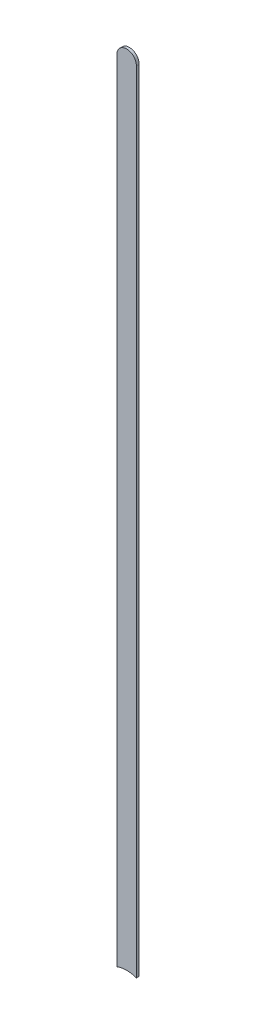
ISO-10303-21;
HEADER;
FILE_DESCRIPTION(('STEP AP214'),'2;1');
FILE_NAME('part.step','',(''),(''),'','','');
FILE_SCHEMA(('AUTOMOTIVE_DESIGN { 1 0 10303 214 1 1 1 1 }'));
ENDSEC;
DATA;
#1=APPLICATION_CONTEXT('core data for automotive mechanical design processes');
#2=APPLICATION_PROTOCOL_DEFINITION('international standard','automotive_design',2000,#1);
#3=PRODUCT_CONTEXT('',#1,'mechanical');
#4=PRODUCT('Part','Part','',(#3));
#5=PRODUCT_RELATED_PRODUCT_CATEGORY('part','',(#4));
#6=PRODUCT_DEFINITION_FORMATION('','',#4);
#7=PRODUCT_DEFINITION_CONTEXT('part definition',#1,'design');
#8=PRODUCT_DEFINITION('design','',#6,#7);
#9=PRODUCT_DEFINITION_SHAPE('','',#8);
#10=(LENGTH_UNIT() NAMED_UNIT(*) SI_UNIT(.MILLI.,.METRE.));
#11=(NAMED_UNIT(*) PLANE_ANGLE_UNIT() SI_UNIT($,.RADIAN.));
#12=(NAMED_UNIT(*) SI_UNIT($,.STERADIAN.) SOLID_ANGLE_UNIT());
#13=UNCERTAINTY_MEASURE_WITH_UNIT(LENGTH_MEASURE(1.E-05),#10,'distance_accuracy_value','');
#14=(GEOMETRIC_REPRESENTATION_CONTEXT(3) GLOBAL_UNCERTAINTY_ASSIGNED_CONTEXT((#13)) GLOBAL_UNIT_ASSIGNED_CONTEXT((#10,
#11,#12)) REPRESENTATION_CONTEXT('',''));
#15=CARTESIAN_POINT('',(0.,0.,0.));
#16=DIRECTION('',(0.,0.,1.));
#17=DIRECTION('',(1.,0.,0.));
#18=AXIS2_PLACEMENT_3D('',#15,#16,#17);
#19=CARTESIAN_POINT('',(90.34397222,84.5191196794978,0.));
#20=DIRECTION('',(-1.,0.,0.));
#21=DIRECTION('',(0.,1.,0.));
#22=AXIS2_PLACEMENT_3D('',#19,#20,#21);
#23=PLANE('',#22);
#24=DIRECTION('',(0.,1.,0.));
#25=VECTOR('',#24,1.);
#26=CARTESIAN_POINT('',(90.34397222,84.18697158,0.03556));
#27=LINE('',#26,#25);
#28=CARTESIAN_POINT('',(90.34397222,84.5191196794978,0.03556));
#29=VERTEX_POINT('',#28);
#30=CARTESIAN_POINT('',(90.34397222,94.78697324,0.03556));
#31=VERTEX_POINT('',#30);
#32=EDGE_CURVE('E11',#29,#31,#27,.T.);
#33=ORIENTED_EDGE('',*,*,#32,.F.);
#34=DIRECTION('',(0.,0.,1.));
#35=VECTOR('',#34,1.);
#36=CARTESIAN_POINT('',(90.34397222,84.5191196794978,0.));
#37=LINE('',#36,#35);
#38=CARTESIAN_POINT('',(90.34397222,84.5191196794978,0.));
#39=VERTEX_POINT('',#38);
#40=EDGE_CURVE('E24',#39,#29,#37,.T.);
#41=ORIENTED_EDGE('',*,*,#40,.F.);
#42=DIRECTION('',(0.,1.,0.));
#43=VECTOR('',#42,1.);
#44=CARTESIAN_POINT('',(90.34397222,84.18697158,0.));
#45=LINE('',#44,#43);
#46=CARTESIAN_POINT('',(90.34397222,94.78697324,0.));
#47=VERTEX_POINT('',#46);
#48=EDGE_CURVE('E75',#39,#47,#45,.T.);
#49=ORIENTED_EDGE('',*,*,#48,.T.);
#50=DIRECTION('',(0.,0.,1.));
#51=VECTOR('',#50,1.);
#52=CARTESIAN_POINT('',(90.34397222,94.78697324,0.));
#53=LINE('',#52,#51);
#54=EDGE_CURVE('E37',#47,#31,#53,.T.);
#55=ORIENTED_EDGE('',*,*,#54,.T.);
#56=EDGE_LOOP('',(#33,#41,#49,#55));
#57=FACE_BOUND('',#56,.T.);
#58=ADVANCED_FACE('F17',(#57),#23,.F.);
#59=CARTESIAN_POINT('',(90.21697222,94.78697324,0.));
#60=DIRECTION('',(0.,0.,-1.));
#61=DIRECTION('',(1.,0.,0.));
#62=AXIS2_PLACEMENT_3D('',#59,#60,#61);
#63=CYLINDRICAL_SURFACE('',#62,0.127000000000005);
#64=CARTESIAN_POINT('',(90.21697222,94.78697324,0.03556));
#65=DIRECTION('',(0.,0.,1.));
#66=DIRECTION('',(1.,0.,0.));
#67=AXIS2_PLACEMENT_3D('',#64,#65,#66);
#68=CIRCLE('',#67,0.127000000000005);
#69=CARTESIAN_POINT('',(90.08997222,94.78697324,0.03556));
#70=VERTEX_POINT('',#69);
#71=EDGE_CURVE('E83',#31,#70,#68,.T.);
#72=ORIENTED_EDGE('',*,*,#71,.F.);
#73=ORIENTED_EDGE('',*,*,#54,.F.);
#74=CARTESIAN_POINT('',(90.21697222,94.78697324,0.));
#75=DIRECTION('',(0.,0.,1.));
#76=DIRECTION('',(1.,0.,0.));
#77=AXIS2_PLACEMENT_3D('',#74,#75,#76);
#78=CIRCLE('',#77,0.127000000000005);
#79=CARTESIAN_POINT('',(90.08997222,94.78697324,0.));
#80=VERTEX_POINT('',#79);
#81=EDGE_CURVE('E81',#47,#80,#78,.T.);
#82=ORIENTED_EDGE('',*,*,#81,.T.);
#83=DIRECTION('',(0.,0.,1.));
#84=VECTOR('',#83,1.);
#85=CARTESIAN_POINT('',(90.08997222,94.78697324,0.));
#86=LINE('',#85,#84);
#87=EDGE_CURVE('E67',#80,#70,#86,.T.);
#88=ORIENTED_EDGE('',*,*,#87,.T.);
#89=EDGE_LOOP('',(#72,#73,#82,#88));
#90=FACE_BOUND('',#89,.T.);
#91=ADVANCED_FACE('F89',(#90),#63,.T.);
#92=CARTESIAN_POINT('',(90.08997222,94.78697324,0.));
#93=DIRECTION('',(1.,0.,0.));
#94=DIRECTION('',(0.,-1.,0.));
#95=AXIS2_PLACEMENT_3D('',#92,#93,#94);
#96=PLANE('',#95);
#97=DIRECTION('',(0.,-1.,0.));
#98=VECTOR('',#97,1.);
#99=CARTESIAN_POINT('',(90.08997222,94.78697324,0.03556));
#100=LINE('',#99,#98);
#101=CARTESIAN_POINT('',(90.08997222,84.5191196794978,0.03556));
#102=VERTEX_POINT('',#101);
#103=EDGE_CURVE('E71',#70,#102,#100,.T.);
#104=ORIENTED_EDGE('',*,*,#103,.F.);
#105=ORIENTED_EDGE('',*,*,#87,.F.);
#106=DIRECTION('',(0.,-1.,0.));
#107=VECTOR('',#106,1.);
#108=CARTESIAN_POINT('',(90.08997222,94.78697324,0.));
#109=LINE('',#108,#107);
#110=CARTESIAN_POINT('',(90.08997222,84.5191196794978,0.));
#111=VERTEX_POINT('',#110);
#112=EDGE_CURVE('E63',#80,#111,#109,.T.);
#113=ORIENTED_EDGE('',*,*,#112,.T.);
#114=DIRECTION('',(0.,0.,1.));
#115=VECTOR('',#114,1.);
#116=CARTESIAN_POINT('',(90.08997222,84.5191196794978,0.));
#117=LINE('',#116,#115);
#118=EDGE_CURVE('E53',#111,#102,#117,.T.);
#119=ORIENTED_EDGE('',*,*,#118,.T.);
#120=EDGE_LOOP('',(#104,#105,#113,#119));
#121=FACE_BOUND('',#120,.T.);
#122=ADVANCED_FACE('F66',(#121),#96,.F.);
#123=CARTESIAN_POINT('',(90.21697222,84.18697158,0.));
#124=DIRECTION('',(0.,0.,-1.));
#125=DIRECTION('',(1.,0.,0.));
#126=AXIS2_PLACEMENT_3D('',#123,#124,#125);
#127=CYLINDRICAL_SURFACE('',#126,0.3556);
#128=ORIENTED_EDGE('',*,*,#40,.T.);
#129=CARTESIAN_POINT('',(90.21697222,84.18697158,0.03556));
#130=DIRECTION('',(0.,0.,1.));
#131=DIRECTION('',(1.,0.,0.));
#132=AXIS2_PLACEMENT_3D('',#129,#130,#131);
#133=CIRCLE('',#132,0.3556);
#134=EDGE_CURVE('E59',#29,#102,#133,.T.);
#135=ORIENTED_EDGE('',*,*,#134,.T.);
#136=ORIENTED_EDGE('',*,*,#118,.F.);
#137=CARTESIAN_POINT('',(90.21697222,84.18697158,0.));
#138=DIRECTION('',(0.,0.,1.));
#139=DIRECTION('',(1.,0.,0.));
#140=AXIS2_PLACEMENT_3D('',#137,#138,#139);
#141=CIRCLE('',#140,0.3556);
#142=EDGE_CURVE('E57',#39,#111,#141,.T.);
#143=ORIENTED_EDGE('',*,*,#142,.F.);
#144=EDGE_LOOP('',(#128,#135,#136,#143));
#145=FACE_BOUND('',#144,.T.);
#146=ADVANCED_FACE('F55',(#145),#127,.F.);
#147=CARTESIAN_POINT('',(90.34397222,84.18697158,0.));
#148=DIRECTION('',(0.,0.,-1.));
#149=DIRECTION('',(-1.,0.,0.));
#150=AXIS2_PLACEMENT_3D('',#147,#148,#149);
#151=PLANE('',#150);
#152=ORIENTED_EDGE('',*,*,#48,.F.);
#153=ORIENTED_EDGE('',*,*,#142,.T.);
#154=ORIENTED_EDGE('',*,*,#112,.F.);
#155=ORIENTED_EDGE('',*,*,#81,.F.);
#156=EDGE_LOOP('',(#152,#153,#154,#155));
#157=FACE_BOUND('',#156,.T.);
#158=ADVANCED_FACE('F74',(#157),#151,.T.);
#159=CARTESIAN_POINT('',(90.34397222,84.18697158,0.03556));
#160=DIRECTION('',(0.,0.,-1.));
#161=DIRECTION('',(-1.,0.,0.));
#162=AXIS2_PLACEMENT_3D('',#159,#160,#161);
#163=PLANE('',#162);
#164=ORIENTED_EDGE('',*,*,#134,.F.);
#165=ORIENTED_EDGE('',*,*,#32,.T.);
#166=ORIENTED_EDGE('',*,*,#71,.T.);
#167=ORIENTED_EDGE('',*,*,#103,.T.);
#168=EDGE_LOOP('',(#164,#165,#166,#167));
#169=FACE_BOUND('',#168,.T.);
#170=ADVANCED_FACE('F91',(#169),#163,.F.);
#171=CLOSED_SHELL('',(#58,#91,#122,#146,#158,#170));
#172=MANIFOLD_SOLID_BREP('B1',#171);
#173=ADVANCED_BREP_SHAPE_REPRESENTATION('',(#18,#172),#14);
#174=SHAPE_DEFINITION_REPRESENTATION(#9,#173);
ENDSEC;
END-ISO-10303-21;
